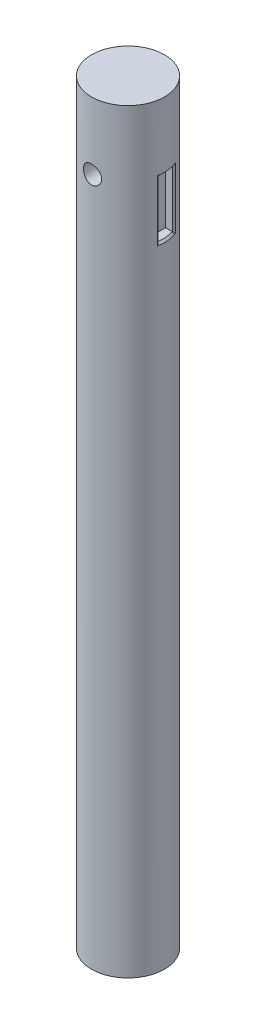
ISO-10303-21;
HEADER;
FILE_DESCRIPTION(('STEP AP214'),'2;1');
FILE_NAME('part.step','',(''),(''),'','','');
FILE_SCHEMA(('AUTOMOTIVE_DESIGN { 1 0 10303 214 1 1 1 1 }'));
ENDSEC;
DATA;
#1=APPLICATION_CONTEXT('core data for automotive mechanical design processes');
#2=APPLICATION_PROTOCOL_DEFINITION('international standard','automotive_design',2000,#1);
#3=PRODUCT_CONTEXT('',#1,'mechanical');
#4=PRODUCT('Part','Part','',(#3));
#5=PRODUCT_RELATED_PRODUCT_CATEGORY('part','',(#4));
#6=PRODUCT_DEFINITION_FORMATION('','',#4);
#7=PRODUCT_DEFINITION_CONTEXT('part definition',#1,'design');
#8=PRODUCT_DEFINITION('design','',#6,#7);
#9=PRODUCT_DEFINITION_SHAPE('','',#8);
#10=(LENGTH_UNIT() NAMED_UNIT(*) SI_UNIT(.MILLI.,.METRE.));
#11=(NAMED_UNIT(*) PLANE_ANGLE_UNIT() SI_UNIT($,.RADIAN.));
#12=(NAMED_UNIT(*) SI_UNIT($,.STERADIAN.) SOLID_ANGLE_UNIT());
#13=UNCERTAINTY_MEASURE_WITH_UNIT(LENGTH_MEASURE(1.E-05),#10,'distance_accuracy_value','');
#14=(GEOMETRIC_REPRESENTATION_CONTEXT(3) GLOBAL_UNCERTAINTY_ASSIGNED_CONTEXT((#13)) GLOBAL_UNIT_ASSIGNED_CONTEXT((#10,
#11,#12)) REPRESENTATION_CONTEXT('',''));
#15=CARTESIAN_POINT('',(0.,0.,0.));
#16=DIRECTION('',(0.,0.,1.));
#17=DIRECTION('',(1.,0.,0.));
#18=AXIS2_PLACEMENT_3D('',#15,#16,#17);
#19=CARTESIAN_POINT('',(0.,394.,0.));
#20=DIRECTION('',(0.,-1.,0.));
#21=DIRECTION('',(0.,0.,-1.));
#22=AXIS2_PLACEMENT_3D('',#19,#20,#21);
#23=CYLINDRICAL_SURFACE('',#22,19.05);
#24=CARTESIAN_POINT('',(0.,360.,0.));
#25=DIRECTION('',(0.,-1.,0.));
#26=DIRECTION('',(0.,0.,-1.));
#27=AXIS2_PLACEMENT_3D('',#24,#25,#26);
#28=CIRCLE('',#27,19.05);
#29=CARTESIAN_POINT('',(18.7710769460592,360.,3.24794862723005));
#30=VERTEX_POINT('',#29);
#31=CARTESIAN_POINT('',(17.7469467547078,360.,-6.92447693949274));
#32=VERTEX_POINT('',#31);
#33=EDGE_CURVE('E200',#30,#32,#28,.F.);
#34=ORIENTED_EDGE('',*,*,#33,.T.);
#35=DIRECTION('',(0.,-1.,0.));
#36=VECTOR('',#35,1.);
#37=CARTESIAN_POINT('',(17.7469467547078,394.,-6.92447693949274));
#38=LINE('',#37,#36);
#39=CARTESIAN_POINT('',(17.7469467547078,328.2,-6.92447693949274));
#40=VERTEX_POINT('',#39);
#41=EDGE_CURVE('E218',#32,#40,#38,.T.);
#42=ORIENTED_EDGE('',*,*,#41,.T.);
#43=CARTESIAN_POINT('',(0.,328.2,0.));
#44=DIRECTION('',(0.,1.,0.));
#45=DIRECTION('',(0.,0.,1.));
#46=AXIS2_PLACEMENT_3D('',#43,#44,#45);
#47=CIRCLE('',#46,19.05);
#48=CARTESIAN_POINT('',(18.7710769460592,328.2,3.24794862723005));
#49=VERTEX_POINT('',#48);
#50=EDGE_CURVE('E213',#40,#49,#47,.F.);
#51=ORIENTED_EDGE('',*,*,#50,.T.);
#52=DIRECTION('',(0.,-1.,0.));
#53=VECTOR('',#52,1.);
#54=CARTESIAN_POINT('',(18.7710769460592,394.,3.24794862723005));
#55=LINE('',#54,#53);
#56=EDGE_CURVE('E211',#49,#30,#55,.F.);
#57=ORIENTED_EDGE('',*,*,#56,.T.);
#58=EDGE_LOOP('',(#34,#42,#51,#57));
#59=FACE_BOUND('',#58,.T.);
#60=CARTESIAN_POINT('',(0.,0.,0.));
#61=DIRECTION('',(0.,1.,0.));
#62=DIRECTION('',(0.,0.,1.));
#63=AXIS2_PLACEMENT_3D('',#60,#61,#62);
#64=CIRCLE('',#63,19.05);
#65=CARTESIAN_POINT('',(0.,0.,19.05));
#66=VERTEX_POINT('',#65);
#67=EDGE_CURVE('E126',#66,#66,#64,.T.);
#68=ORIENTED_EDGE('',*,*,#67,.T.);
#69=EDGE_LOOP('',(#68));
#70=FACE_BOUND('',#69,.T.);
#71=CARTESIAN_POINT('',(0.,394.,0.));
#72=DIRECTION('',(0.,1.,0.));
#73=DIRECTION('',(0.,0.,1.));
#74=AXIS2_PLACEMENT_3D('',#71,#72,#73);
#75=CIRCLE('',#74,19.05);
#76=CARTESIAN_POINT('',(0.,394.,19.05));
#77=VERTEX_POINT('',#76);
#78=EDGE_CURVE('E152',#77,#77,#75,.T.);
#79=ORIENTED_EDGE('',*,*,#78,.F.);
#80=EDGE_LOOP('',(#79));
#81=FACE_BOUND('',#80,.T.);
#82=CARTESIAN_POINT('',(4.76500000000002,359.,18.4444375083655));
#83=CARTESIAN_POINT('',(4.76499253394756,358.736880068242,18.4444425285765));
#84=CARTESIAN_POINT('',(4.74313182145984,358.473677541453,18.4501293147716));
#85=CARTESIAN_POINT('',(4.65640620518508,357.954831138807,18.4722038293386));
#86=CARTESIAN_POINT('',(4.59151629989314,357.699191747664,18.4885977788731));
#87=CARTESIAN_POINT('',(4.42096412981295,357.203051545091,18.530116362269));
#88=CARTESIAN_POINT('',(4.31535453523028,356.962531642371,18.5552297135784));
#89=CARTESIAN_POINT('',(4.06652128468702,356.502597053856,18.6113434099178));
#90=CARTESIAN_POINT('',(3.92329602150706,356.283183270419,18.6423440064788));
#91=CARTESIAN_POINT('',(3.59992696396595,355.866855826511,18.7075036989851));
#92=CARTESIAN_POINT('',(3.41910636519059,355.670475652776,18.7417133012387));
#93=CARTESIAN_POINT('',(3.02713722515421,355.310489970936,18.8089983242118));
#94=CARTESIAN_POINT('',(2.81598584943579,355.146887529385,18.8420736385721));
#95=CARTESIAN_POINT('',(2.36569387066519,354.854918388776,18.9039222142229));
#96=CARTESIAN_POINT('',(2.12620348877931,354.727075821872,18.9326289260712));
#97=CARTESIAN_POINT('',(1.6282940302175,354.513663456559,18.9819296026007));
#98=CARTESIAN_POINT('',(1.36987775584671,354.428087414334,19.0025247654682));
#99=CARTESIAN_POINT('',(0.847013638180613,354.303346197909,19.0329247816014));
#100=CARTESIAN_POINT('',(0.582794371964305,354.263275069739,19.0429399774285));
#101=CARTESIAN_POINT('',(0.0512066238273264,354.227837364209,19.0517846278309));
#102=CARTESIAN_POINT('',(-0.216161386171344,354.232464170752,19.050615737852));
#103=CARTESIAN_POINT('',(-0.740173529842495,354.28563952411,19.0373804769759));
#104=CARTESIAN_POINT('',(-0.996923949372714,354.33321017015,19.0255567446553));
#105=CARTESIAN_POINT('',(-1.49867570045083,354.469350926046,18.992622885621));
#106=CARTESIAN_POINT('',(-1.74367640543007,354.55792321969,18.9715122642813));
#107=CARTESIAN_POINT('',(-2.21754980129284,354.774343937852,18.9220055530041));
#108=CARTESIAN_POINT('',(-2.44625661871719,354.902540279946,18.8935453093686));
#109=CARTESIAN_POINT('',(-2.87925396839516,355.194306109284,18.8324263417817));
#110=CARTESIAN_POINT('',(-3.08354023915232,355.357881756427,18.7997668871067));
#111=CARTESIAN_POINT('',(-3.46772955999337,355.721004651696,18.7327642600676));
#112=CARTESIAN_POINT('',(-3.64682206057596,355.921406395504,18.6983994437385));
#113=CARTESIAN_POINT('',(-3.9690393750814,356.349758243538,18.632668778602));
#114=CARTESIAN_POINT('',(-4.1121625042789,356.577709637389,18.6013030703088));
#115=CARTESIAN_POINT('',(-4.35889808415532,357.056281427722,18.5450444436967));
#116=CARTESIAN_POINT('',(-4.4623151994576,357.307006577916,18.520183712875));
#117=CARTESIAN_POINT('',(-4.62527858668667,357.823056281148,18.4801627604254));
#118=CARTESIAN_POINT('',(-4.68483425787015,358.088377693186,18.4650004605706));
#119=CARTESIAN_POINT('',(-4.75703893537006,358.618571046615,18.4465293229528));
#120=CARTESIAN_POINT('',(-4.77088646820728,358.883269408923,18.442917692324));
#121=CARTESIAN_POINT('',(-4.75456315449025,359.411195338961,18.4471325852967));
#122=CARTESIAN_POINT('',(-4.72439636472194,359.674423039997,18.4549580547444));
#123=CARTESIAN_POINT('',(-4.62195164618803,360.187483708471,18.4808752454782));
#124=CARTESIAN_POINT('',(-4.55037170986199,360.437465469567,18.4987966771173));
#125=CARTESIAN_POINT('',(-4.3679065766642,360.921881551656,18.5427247883423));
#126=CARTESIAN_POINT('',(-4.25701671996747,361.156314025512,18.5687324264277));
#127=CARTESIAN_POINT('',(-3.99657145809522,361.608054560514,18.6265399386717));
#128=CARTESIAN_POINT('',(-3.8462995878392,361.824935987912,18.6584435191855));
#129=CARTESIAN_POINT('',(-3.51226176217666,362.230844297488,18.7241938256162));
#130=CARTESIAN_POINT('',(-3.32849029641703,362.419866587849,18.7580408705853));
#131=CARTESIAN_POINT('',(-2.92716913307845,362.769546987513,18.824890712737));
#132=CARTESIAN_POINT('',(-2.70888859662654,362.929375944846,18.8578511212472));
#133=CARTESIAN_POINT('',(-2.24789098441666,363.21011029119,18.91833630164));
#134=CARTESIAN_POINT('',(-2.00517518449521,363.331017711027,18.9458613570961));
#135=CARTESIAN_POINT('',(-1.50387454132551,363.529426643736,18.9922009859132));
#136=CARTESIAN_POINT('',(-1.24541934639064,363.607240441396,19.0110780510668));
#137=CARTESIAN_POINT('',(-0.718566131278507,363.718190436356,19.0382683438607));
#138=CARTESIAN_POINT('',(-0.450170042410288,363.751335265612,19.046583612474));
#139=CARTESIAN_POINT('',(0.0811569645299681,363.771520485466,19.0516300031007));
#140=CARTESIAN_POINT('',(0.344039181675933,363.759784471426,19.0486685735105));
#141=CARTESIAN_POINT('',(0.863959572964795,363.693344058803,19.0321762045503));
#142=CARTESIAN_POINT('',(1.12099792100998,363.638640940563,19.018645580124));
#143=CARTESIAN_POINT('',(1.62065205147048,363.488475647959,18.9825827762077));
#144=CARTESIAN_POINT('',(1.86333815295653,363.393234927861,18.9600995466223));
#145=CARTESIAN_POINT('',(2.3294229185804,363.164898899249,18.9084989834101));
#146=CARTESIAN_POINT('',(2.55281914450257,363.031798814464,18.8793808128229));
#147=CARTESIAN_POINT('',(2.97978360927443,362.727791723533,18.8167772861324));
#148=CARTESIAN_POINT('',(3.18274795985907,362.556054695466,18.7832039537837));
#149=CARTESIAN_POINT('',(3.55739239819725,362.181259900192,18.7158694747159));
#150=CARTESIAN_POINT('',(3.72906453995355,361.978194201833,18.6821082825303));
#151=CARTESIAN_POINT('',(4.03940000761458,361.541940131255,18.6175025683245));
#152=CARTESIAN_POINT('',(4.17738679555634,361.308259908803,18.5867243135507));
#153=CARTESIAN_POINT('',(4.41191121503437,360.820282184805,18.5324615547298));
#154=CARTESIAN_POINT('',(4.50847898039926,360.565999832729,18.508971751525));
#155=CARTESIAN_POINT('',(4.6430615235032,360.093474198049,18.4756133752866));
#156=CARTESIAN_POINT('',(4.68868870992555,359.8774902163,18.4640104602906));
#157=CARTESIAN_POINT('',(4.74965978251172,359.441023240886,18.4484207485055));
#158=CARTESIAN_POINT('',(4.76500625786094,359.220540633512,18.4444333005485));
#159=CARTESIAN_POINT('',(4.76500000000002,359.,18.4444375083655));
#160=B_SPLINE_CURVE_WITH_KNOTS('',3,(#82,#83,#84,#85,#86,#87,#88,#89,#90,#91,#92,#93,#94,#95,
#96,#97,#98,#99,#100,#101,#102,#103,#104,#105,#106,#107,#108,#109,#110,#111,#112,#113,#114,#115,
#116,#117,#118,#119,#120,#121,#122,#123,#124,#125,#126,#127,#128,#129,#130,#131,#132,#133,#134,
#135,#136,#137,#138,#139,#140,#141,#142,#143,#144,#145,#146,#147,#148,#149,#150,#151,#152,#153,
#154,#155,#156,#157,#158,#159),.UNSPECIFIED.,.T.,.F.,(4,2,2,2,2,2,2,2,2,2,2,2,2,2,2,2,2,2,2,2,2,
2,2,2,2,2,2,2,2,2,2,2,2,2,2,2,2,2,4),(0.,0.788549891288974,1.57755836029502,2.36554966597998,
3.15357464595635,3.95725215471359,4.76100481728096,5.57598509752509,6.39084494888725,
7.18918063523408,7.98739815537882,8.76788515535764,9.54841372963677,10.3360003461753,
11.1237242001489,11.932789468102,12.7418926238134,13.5549266948542,14.3677864866061,
15.1591552295999,15.9504510369988,16.728783250779,17.5072077594643,18.3009170589978,
19.0947570338869,19.9084830626429,20.7221666263988,21.5298738556445,22.3374249789063,
23.1231186778021,23.9087889652832,24.6902211892097,25.4717520410272,26.2720227559754,
27.0724964005802,27.887923493764,28.7027563239447,29.3637559048892,30.0246989638899),.UNSPECIFIED.);
#161=CARTESIAN_POINT('',(4.76500000000002,359.,18.4444375083655));
#162=VERTEX_POINT('',#161);
#163=EDGE_CURVE('E155',#162,#162,#160,.T.);
#164=ORIENTED_EDGE('',*,*,#163,.T.);
#165=EDGE_LOOP('',(#164));
#166=FACE_BOUND('',#165,.T.);
#167=CARTESIAN_POINT('',(0.,363.765,-19.05));
#168=CARTESIAN_POINT('',(-0.26326521125486,363.764992620144,-19.0499955515464));
#169=CARTESIAN_POINT('',(-0.526612834496201,363.743108589917,-19.0444882667373));
#170=CARTESIAN_POINT('',(-1.04576024353248,363.656281974442,-19.0230522770523));
#171=CARTESIAN_POINT('',(-1.30155567066715,363.591315012891,-19.0071176724709));
#172=CARTESIAN_POINT('',(-1.79802679301538,363.420537663011,-18.9665915031212));
#173=CARTESIAN_POINT('',(-2.0387202526176,363.314776349414,-18.9420103430908));
#174=CARTESIAN_POINT('',(-2.4989488240798,363.065585179318,-18.886808821123));
#175=CARTESIAN_POINT('',(-2.7184832164683,362.92215404255,-18.8561882539356));
#176=CARTESIAN_POINT('',(-3.13468790260628,362.598571393309,-18.7915262162897));
#177=CARTESIAN_POINT('',(-3.3308598616217,362.41778942701,-18.7574319232655));
#178=CARTESIAN_POINT('',(-3.69043987258169,362.02598664335,-18.6900159213816));
#179=CARTESIAN_POINT('',(-3.85384422121505,361.814962412702,-18.6566943002231));
#180=CARTESIAN_POINT('',(-4.1455949750689,361.364795076123,-18.5940638080123));
#181=CARTESIAN_POINT('',(-4.2733837991845,361.125280428019,-18.5648219918294));
#182=CARTESIAN_POINT('',(-4.48669026961246,360.627318980245,-18.5144323480421));
#183=CARTESIAN_POINT('',(-4.57221468179625,360.368875218443,-18.4932832250464));
#184=CARTESIAN_POINT('',(-4.69686433359866,359.845871711618,-18.4620164523183));
#185=CARTESIAN_POINT('',(-4.73688563940207,359.581538542251,-18.4516860894675));
#186=CARTESIAN_POINT('',(-4.77218413773464,359.049723670487,-18.4425897804384));
#187=CARTESIAN_POINT('',(-4.76746861781131,358.782242487986,-18.4438219507441));
#188=CARTESIAN_POINT('',(-4.714142227105,358.258593091358,-18.4575202823196));
#189=CARTESIAN_POINT('',(-4.666599264599,358.002307858781,-18.4697131224584));
#190=CARTESIAN_POINT('',(-4.53067116110666,357.501471654451,-18.5035233716592));
#191=CARTESIAN_POINT('',(-4.44228310778031,357.256921520807,-18.5251414527542));
#192=CARTESIAN_POINT('',(-4.22626405623028,356.783634436915,-18.5756171646484));
#193=CARTESIAN_POINT('',(-4.09824558451351,356.555082221851,-18.6045457343777));
#194=CARTESIAN_POINT('',(-3.80687066061065,356.122320934521,-18.6663428672246));
#195=CARTESIAN_POINT('',(-3.64350801875435,355.918116135841,-18.6992121200066));
#196=CARTESIAN_POINT('',(-3.28055094507251,355.533726714641,-18.7663377909751));
#197=CARTESIAN_POINT('',(-3.08005537492096,355.35439415423,-18.8006070231433));
#198=CARTESIAN_POINT('',(-2.65142565171569,355.031735263645,-18.8658253171989));
#199=CARTESIAN_POINT('',(-2.42329065299133,354.888410035584,-18.8967742774429));
#200=CARTESIAN_POINT('',(-1.94464142166658,354.641520890416,-18.9520192245389));
#201=CARTESIAN_POINT('',(-1.69405287727384,354.53809550092,-18.9762919500539));
#202=CARTESIAN_POINT('',(-1.17830380293655,354.375075177787,-19.0152803673754));
#203=CARTESIAN_POINT('',(-0.913146073888303,354.315471850913,-19.0299978892262));
#204=CARTESIAN_POINT('',(-0.383070389815676,354.243089137922,-19.0479467753632));
#205=CARTESIAN_POINT('',(-0.118320282238044,354.22914942532,-19.0514627104745));
#206=CARTESIAN_POINT('',(0.409730011595897,354.245307001117,-19.0474228424188));
#207=CARTESIAN_POINT('',(0.673030326369713,354.275400320989,-19.0398680370146));
#208=CARTESIAN_POINT('',(1.18667400021568,354.377813359581,-19.0147179247928));
#209=CARTESIAN_POINT('',(1.43715163707319,354.44949996186,-18.9972732469182));
#210=CARTESIAN_POINT('',(1.92251297115368,354.632341387155,-18.9543097733156));
#211=CARTESIAN_POINT('',(2.15739508973183,354.743500198507,-18.9287901617114));
#212=CARTESIAN_POINT('',(2.60951359661004,355.004378690255,-18.871826229655));
#213=CARTESIAN_POINT('',(2.82636253382392,355.154748119556,-18.8402847401568));
#214=CARTESIAN_POINT('',(3.23216102113293,355.488948981439,-18.7749288358825));
#215=CARTESIAN_POINT('',(3.42110574075645,355.672786195327,-18.7411140290455));
#216=CARTESIAN_POINT('',(3.77051471095469,356.07409168763,-18.673998119737));
#217=CARTESIAN_POINT('',(3.93016499899017,356.292275389046,-18.6407300602087));
#218=CARTESIAN_POINT('',(4.2105854147061,356.753021521654,-18.5794013573027));
#219=CARTESIAN_POINT('',(4.33135726781047,356.99558287034,-18.5513404828537));
#220=CARTESIAN_POINT('',(4.52969340489564,357.496898945324,-18.5039125929347));
#221=CARTESIAN_POINT('',(4.60751366895123,357.755547283737,-18.4844942078739));
#222=CARTESIAN_POINT('',(4.71841159828721,358.282816173773,-18.4565008772953));
#223=CARTESIAN_POINT('',(4.75149906088238,358.551434528531,-18.4479235574097));
#224=CARTESIAN_POINT('',(4.77147984461422,359.082735021092,-18.4427646152436));
#225=CARTESIAN_POINT('',(4.75967418884682,359.345365732915,-18.4458451309353));
#226=CARTESIAN_POINT('',(4.69318177062746,359.864764098748,-18.4628735437947));
#227=CARTESIAN_POINT('',(4.63849587168856,360.121531870715,-18.4768212221219));
#228=CARTESIAN_POINT('',(4.48850620730767,360.620499353916,-18.5138240010824));
#229=CARTESIAN_POINT('',(4.39344670349075,360.862776835954,-18.5368242728665));
#230=CARTESIAN_POINT('',(4.16560150003316,361.32811732356,-18.5893483537122));
#231=CARTESIAN_POINT('',(4.03281056243546,361.551177655755,-18.618873068384));
#232=CARTESIAN_POINT('',(3.72919412213602,361.978038269465,-18.6820826268311));
#233=CARTESIAN_POINT('',(3.55746599960889,362.181183538894,-18.7158559691186));
#234=CARTESIAN_POINT('',(3.18260855149614,362.556196890561,-18.7832292865691));
#235=CARTESIAN_POINT('',(2.97947177857618,362.728057533774,-18.8168292186571));
#236=CARTESIAN_POINT('',(2.54311718061299,363.038662123919,-18.8807970293255));
#237=CARTESIAN_POINT('',(2.30942064553615,363.17674898282,-18.9110952448362));
#238=CARTESIAN_POINT('',(1.82139399193014,363.411456333857,-18.9643106376113));
#239=CARTESIAN_POINT('',(1.56707880237167,363.508106515025,-18.9872330965958));
#240=CARTESIAN_POINT('',(1.09435178682454,363.642864288432,-19.0197288497069));
#241=CARTESIAN_POINT('',(0.878190056555764,363.688566119122,-19.0310025178053));
#242=CARTESIAN_POINT('',(0.441371299102448,363.749635925223,-19.0461396784107));
#243=CARTESIAN_POINT('',(0.220714612022164,363.765006187076,-19.0500037294662));
#244=CARTESIAN_POINT('',(0.,363.765,-19.05));
#245=B_SPLINE_CURVE_WITH_KNOTS('',3,(#167,#168,#169,#170,#171,#172,#173,#174,#175,#176,#177,
#178,#179,#180,#181,#182,#183,#184,#185,#186,#187,#188,#189,#190,#191,#192,#193,#194,#195,#196,
#197,#198,#199,#200,#201,#202,#203,#204,#205,#206,#207,#208,#209,#210,#211,#212,#213,#214,#215,
#216,#217,#218,#219,#220,#221,#222,#223,#224,#225,#226,#227,#228,#229,#230,#231,#232,#233,#234,
#235,#236,#237,#238,#239,#240,#241,#242,#243,#244),.UNSPECIFIED.,.T.,.F.,(4,2,2,2,2,2,2,2,2,2,2,
2,2,2,2,2,2,2,2,2,2,2,2,2,2,2,2,2,2,2,2,2,2,2,2,2,2,2,4),(0.,0.788986790709137,1.57842037111027,
2.36690722681282,3.15542088397196,3.95852747037524,4.76172477073223,5.57686839212704,
6.39188147946916,7.19055082686619,7.98909007471397,8.76825256617256,9.54747062211313,
10.3345616140848,11.1217905575999,11.9314913183108,12.7412168593157,13.553728902364,
14.3660852844672,15.1576324402231,15.9491082612997,16.7288413462058,17.5086532390679,
18.3023138998786,19.0961117898661,19.909416117703,20.7226843461374,21.5310518823165,
22.3392423422858,23.1241920278443,23.9091259066618,24.6893770793649,25.4697366211415,
26.2704729859314,27.0713995060536,27.8868507374529,28.7017167244678,29.3632323158843,
30.0246980392586),.UNSPECIFIED.);
#246=CARTESIAN_POINT('',(0.,363.765,-19.05));
#247=VERTEX_POINT('',#246);
#248=EDGE_CURVE('E165',#247,#247,#245,.T.);
#249=ORIENTED_EDGE('',*,*,#248,.T.);
#250=EDGE_LOOP('',(#249));
#251=FACE_BOUND('',#250,.T.);
#252=ADVANCED_FACE('F45',(#59,#70,#81,#166,#251),#23,.T.);
#253=CARTESIAN_POINT('',(0.,394.,0.));
#254=DIRECTION('',(0.,1.,0.));
#255=DIRECTION('',(0.,0.,1.));
#256=AXIS2_PLACEMENT_3D('',#253,#254,#255);
#257=PLANE('',#256);
#258=ORIENTED_EDGE('',*,*,#78,.T.);
#259=EDGE_LOOP('',(#258));
#260=FACE_BOUND('',#259,.T.);
#261=ADVANCED_FACE('F182',(#260),#257,.T.);
#262=CARTESIAN_POINT('',(0.,0.,0.));
#263=DIRECTION('',(0.,1.,0.));
#264=DIRECTION('',(0.,0.,1.));
#265=AXIS2_PLACEMENT_3D('',#262,#263,#264);
#266=PLANE('',#265);
#267=ORIENTED_EDGE('',*,*,#67,.F.);
#268=EDGE_LOOP('',(#267));
#269=FACE_BOUND('',#268,.T.);
#270=ADVANCED_FACE('F178',(#269),#266,.F.);
#271=CARTESIAN_POINT('',(0.,359.,-19.05));
#272=DIRECTION('',(0.,0.,1.));
#273=DIRECTION('',(1.,0.,0.));
#274=AXIS2_PLACEMENT_3D('',#271,#272,#273);
#275=CYLINDRICAL_SURFACE('',#274,4.76500000000001);
#276=ORIENTED_EDGE('',*,*,#163,.F.);
#277=EDGE_LOOP('',(#276));
#278=FACE_BOUND('',#277,.T.);
#279=ORIENTED_EDGE('',*,*,#248,.F.);
#280=EDGE_LOOP('',(#279));
#281=FACE_BOUND('',#280,.T.);
#282=ADVANCED_FACE('F173',(#278,#281),#275,.F.);
#283=CARTESIAN_POINT('',(19.050012,329.2,-6.00706364757789));
#284=DIRECTION('',(0.,0.,1.));
#285=DIRECTION('',(1.,0.,0.));
#286=AXIS2_PLACEMENT_3D('',#283,#284,#285);
#287=PLANE('',#286);
#288=DIRECTION('',(-1.,0.,0.));
#289=VECTOR('',#288,1.);
#290=CARTESIAN_POINT('',(19.050012,329.2,-6.00706364757789));
#291=LINE('',#290,#289);
#292=CARTESIAN_POINT('',(17.0210953329669,329.2,-6.00706364757789));
#293=VERTEX_POINT('',#292);
#294=CARTESIAN_POINT('',(13.6,329.2,-6.00706364757789));
#295=VERTEX_POINT('',#294);
#296=EDGE_CURVE('E147',#293,#295,#291,.T.);
#297=ORIENTED_EDGE('',*,*,#296,.F.);
#298=CARTESIAN_POINT('',(17.0210953329669,329.2,-6.00706364757789));
#299=CARTESIAN_POINT('',(17.0654565201665,329.158167273964,-6.00706364757789));
#300=CARTESIAN_POINT('',(17.1098088586606,329.116325172334,-6.00706364757789));
#301=CARTESIAN_POINT('',(17.1984958382102,329.03262221791,-6.00706364757789));
#302=CARTESIAN_POINT('',(17.2428304792658,328.990761365117,-6.00706364757789));
#303=CARTESIAN_POINT('',(17.2871562716159,328.948891136728,-6.00706364757789));
#304=B_SPLINE_CURVE_WITH_KNOTS('',3,(#298,#299,#300,#301,#302,#303),.UNSPECIFIED.,.F.,.F.,(4,2,
4),(0.,0.182923543013357,0.365847085913804),.UNSPECIFIED.);
#305=CARTESIAN_POINT('',(17.2871562716159,328.948891136728,-6.00706364757789));
#306=VERTEX_POINT('',#305);
#307=EDGE_CURVE('E60',#293,#306,#304,.T.);
#308=ORIENTED_EDGE('',*,*,#307,.T.);
#309=DIRECTION('',(0.,1.,0.));
#310=VECTOR('',#309,1.);
#311=CARTESIAN_POINT('',(17.2871562716159,359.,-6.00706364757789));
#312=LINE('',#311,#310);
#313=CARTESIAN_POINT('',(17.2871562716159,359.251108863272,-6.00706364757789));
#314=VERTEX_POINT('',#313);
#315=EDGE_CURVE('E210',#306,#314,#312,.T.);
#316=ORIENTED_EDGE('',*,*,#315,.T.);
#317=CARTESIAN_POINT('',(17.2871562716159,359.251108863272,-6.00706364757789));
#318=CARTESIAN_POINT('',(17.2428304792659,359.209238634883,-6.00706364757789));
#319=CARTESIAN_POINT('',(17.1984958382103,359.16737778209,-6.00706364757789));
#320=CARTESIAN_POINT('',(17.1098088586606,359.083674827666,-6.00706364757789));
#321=CARTESIAN_POINT('',(17.0654565201666,359.041832726036,-6.00706364757789));
#322=CARTESIAN_POINT('',(17.021095332967,359.,-6.00706364757789));
#323=B_SPLINE_CURVE_WITH_KNOTS('',3,(#317,#318,#319,#320,#321,#322),.UNSPECIFIED.,.F.,.F.,(4,2,
4),(0.,0.182923542900389,0.365847085913736),.UNSPECIFIED.);
#324=CARTESIAN_POINT('',(17.021095332967,359.,-6.00706364757789));
#325=VERTEX_POINT('',#324);
#326=EDGE_CURVE('E123',#314,#325,#323,.T.);
#327=ORIENTED_EDGE('',*,*,#326,.T.);
#328=DIRECTION('',(-1.,0.,0.));
#329=VECTOR('',#328,1.);
#330=CARTESIAN_POINT('',(19.050012,359.,-6.00706364757789));
#331=LINE('',#330,#329);
#332=CARTESIAN_POINT('',(13.6,359.,-6.00706364757789));
#333=VERTEX_POINT('',#332);
#334=EDGE_CURVE('E115',#325,#333,#331,.T.);
#335=ORIENTED_EDGE('',*,*,#334,.T.);
#336=DIRECTION('',(0.,1.,0.));
#337=VECTOR('',#336,1.);
#338=CARTESIAN_POINT('',(13.6,329.2,-6.00706364757789));
#339=LINE('',#338,#337);
#340=EDGE_CURVE('E120',#295,#333,#339,.T.);
#341=ORIENTED_EDGE('',*,*,#340,.F.);
#342=EDGE_LOOP('',(#297,#308,#316,#327,#335,#341));
#343=FACE_BOUND('',#342,.T.);
#344=ADVANCED_FACE('F118',(#343),#287,.T.);
#345=CARTESIAN_POINT('',(19.050012,359.,2.28293635242211));
#346=DIRECTION('',(0.,-1.,0.));
#347=DIRECTION('',(0.,0.,-1.));
#348=AXIS2_PLACEMENT_3D('',#345,#346,#347);
#349=PLANE('',#348);
#350=ORIENTED_EDGE('',*,*,#334,.F.);
#351=CARTESIAN_POINT('',(0.,359.,0.));
#352=DIRECTION('',(0.,-1.,0.));
#353=DIRECTION('',(0.,0.,-1.));
#354=AXIS2_PLACEMENT_3D('',#351,#352,#353);
#355=CIRCLE('',#354,18.05);
#356=CARTESIAN_POINT('',(17.9050468195643,359.,2.28293635242211));
#357=VERTEX_POINT('',#356);
#358=EDGE_CURVE('E220',#325,#357,#355,.T.);
#359=ORIENTED_EDGE('',*,*,#358,.T.);
#360=DIRECTION('',(-1.,0.,0.));
#361=VECTOR('',#360,1.);
#362=CARTESIAN_POINT('',(19.050012,359.,2.28293635242211));
#363=LINE('',#362,#361);
#364=CARTESIAN_POINT('',(13.6,359.,2.28293635242211));
#365=VERTEX_POINT('',#364);
#366=EDGE_CURVE('E127',#357,#365,#363,.T.);
#367=ORIENTED_EDGE('',*,*,#366,.T.);
#368=DIRECTION('',(0.,0.,1.));
#369=VECTOR('',#368,1.);
#370=CARTESIAN_POINT('',(13.6,359.,2.28293635242211));
#371=LINE('',#370,#369);
#372=EDGE_CURVE('E130',#333,#365,#371,.T.);
#373=ORIENTED_EDGE('',*,*,#372,.F.);
#374=EDGE_LOOP('',(#350,#359,#367,#373));
#375=FACE_BOUND('',#374,.T.);
#376=ADVANCED_FACE('F131',(#375),#349,.T.);
#377=CARTESIAN_POINT('',(19.050012,329.2,2.28293635242211));
#378=DIRECTION('',(0.,0.,-1.));
#379=DIRECTION('',(-1.,0.,0.));
#380=AXIS2_PLACEMENT_3D('',#377,#378,#379);
#381=PLANE('',#380);
#382=CARTESIAN_POINT('',(17.9050468195643,359.,2.28293635242211));
#383=CARTESIAN_POINT('',(17.9231966728105,359.018004100798,2.28293635242211));
#384=CARTESIAN_POINT('',(17.9413463090667,359.036008420332,2.28293635242211));
#385=CARTESIAN_POINT('',(17.9776451475991,359.072017496872,2.28293635242211));
#386=CARTESIAN_POINT('',(17.9957943498752,359.090022253878,2.28293635242211));
#387=CARTESIAN_POINT('',(18.0139433351614,359.10802722962,2.28293635242211));
#388=B_SPLINE_CURVE_WITH_KNOTS('',3,(#382,#383,#384,#385,#386,#387),.UNSPECIFIED.,.F.,.F.,(4,2,
4),(0.,0.0766947414298417,0.153389482859611),.UNSPECIFIED.);
#389=CARTESIAN_POINT('',(18.0139433351614,359.10802722962,2.28293635242211));
#390=VERTEX_POINT('',#389);
#391=EDGE_CURVE('E225',#357,#390,#388,.T.);
#392=ORIENTED_EDGE('',*,*,#391,.T.);
#393=DIRECTION('',(0.,-1.,0.));
#394=VECTOR('',#393,1.);
#395=CARTESIAN_POINT('',(18.0139433351614,329.2,2.28293635242211));
#396=LINE('',#395,#394);
#397=CARTESIAN_POINT('',(18.0139433351614,329.09197277038,2.28293635242211));
#398=VERTEX_POINT('',#397);
#399=EDGE_CURVE('E67',#390,#398,#396,.T.);
#400=ORIENTED_EDGE('',*,*,#399,.T.);
#401=CARTESIAN_POINT('',(18.0139433351614,329.09197277038,2.28293635242211));
#402=CARTESIAN_POINT('',(17.9957943498753,329.109977746122,2.28293635242211));
#403=CARTESIAN_POINT('',(17.9776451475991,329.127982503128,2.28293635242211));
#404=CARTESIAN_POINT('',(17.9413463090667,329.163991579668,2.28293635242211));
#405=CARTESIAN_POINT('',(17.9231966728105,329.181995899202,2.28293635242211));
#406=CARTESIAN_POINT('',(17.9050468195643,329.2,2.28293635242211));
#407=B_SPLINE_CURVE_WITH_KNOTS('',3,(#401,#402,#403,#404,#405,#406),.UNSPECIFIED.,.F.,.F.,(4,2,
4),(0.,0.0766947414298326,0.153389482859738),.UNSPECIFIED.);
#408=CARTESIAN_POINT('',(17.9050468195643,329.2,2.28293635242211));
#409=VERTEX_POINT('',#408);
#410=EDGE_CURVE('E11',#398,#409,#407,.T.);
#411=ORIENTED_EDGE('',*,*,#410,.T.);
#412=DIRECTION('',(-1.,0.,0.));
#413=VECTOR('',#412,1.);
#414=CARTESIAN_POINT('',(19.050012,329.2,2.28293635242211));
#415=LINE('',#414,#413);
#416=CARTESIAN_POINT('',(13.6,329.2,2.28293635242211));
#417=VERTEX_POINT('',#416);
#418=EDGE_CURVE('E149',#409,#417,#415,.T.);
#419=ORIENTED_EDGE('',*,*,#418,.T.);
#420=DIRECTION('',(0.,-1.,0.));
#421=VECTOR('',#420,1.);
#422=CARTESIAN_POINT('',(13.6,329.2,2.28293635242211));
#423=LINE('',#422,#421);
#424=EDGE_CURVE('E136',#365,#417,#423,.T.);
#425=ORIENTED_EDGE('',*,*,#424,.F.);
#426=ORIENTED_EDGE('',*,*,#366,.F.);
#427=EDGE_LOOP('',(#392,#400,#411,#419,#425,#426));
#428=FACE_BOUND('',#427,.T.);
#429=ADVANCED_FACE('F241',(#428),#381,.T.);
#430=CARTESIAN_POINT('',(19.050012,329.2,2.28293635242211));
#431=DIRECTION('',(0.,1.,0.));
#432=DIRECTION('',(0.,0.,1.));
#433=AXIS2_PLACEMENT_3D('',#430,#431,#432);
#434=PLANE('',#433);
#435=ORIENTED_EDGE('',*,*,#418,.F.);
#436=CARTESIAN_POINT('',(0.,329.2,0.));
#437=DIRECTION('',(0.,1.,0.));
#438=DIRECTION('',(0.,0.,1.));
#439=AXIS2_PLACEMENT_3D('',#436,#437,#438);
#440=CIRCLE('',#439,18.05);
#441=EDGE_CURVE('E222',#409,#293,#440,.T.);
#442=ORIENTED_EDGE('',*,*,#441,.T.);
#443=ORIENTED_EDGE('',*,*,#296,.T.);
#444=DIRECTION('',(0.,0.,-1.));
#445=VECTOR('',#444,1.);
#446=CARTESIAN_POINT('',(13.6,329.2,2.28293635242211));
#447=LINE('',#446,#445);
#448=EDGE_CURVE('E140',#417,#295,#447,.T.);
#449=ORIENTED_EDGE('',*,*,#448,.F.);
#450=EDGE_LOOP('',(#435,#442,#443,#449));
#451=FACE_BOUND('',#450,.T.);
#452=ADVANCED_FACE('F245',(#451),#434,.T.);
#453=CARTESIAN_POINT('',(13.6,0.,0.));
#454=DIRECTION('',(-1.,0.,0.));
#455=DIRECTION('',(0.,0.,1.));
#456=AXIS2_PLACEMENT_3D('',#453,#454,#455);
#457=PLANE('',#456);
#458=ORIENTED_EDGE('',*,*,#340,.T.);
#459=ORIENTED_EDGE('',*,*,#372,.T.);
#460=ORIENTED_EDGE('',*,*,#424,.T.);
#461=ORIENTED_EDGE('',*,*,#448,.T.);
#462=EDGE_LOOP('',(#458,#459,#460,#461));
#463=FACE_BOUND('',#462,.T.);
#464=ADVANCED_FACE('F138',(#463),#457,.F.);
#465=CARTESIAN_POINT('',(18.0139433351614,394.,2.28293635242211));
#466=DIRECTION('',(-0.786749982963788,0.,0.617271791277133));
#467=DIRECTION('',(0.,-1.,0.));
#468=AXIS2_PLACEMENT_3D('',#465,#466,#467);
#469=PLANE('',#468);
#470=CARTESIAN_POINT('',(18.0139433351614,359.10802722962,2.28293635242211));
#471=CARTESIAN_POINT('',(18.0775174711185,359.181284759428,2.36396540816054));
#472=CARTESIAN_POINT('',(18.1409655250461,359.254829143086,2.44483376477757));
#473=CARTESIAN_POINT('',(18.2676174843139,359.402462077249,2.60625929596882));
#474=CARTESIAN_POINT('',(18.3308213959147,359.476550613657,2.68681647852255));
#475=CARTESIAN_POINT('',(18.4569962510612,359.625245960576,2.84763391184729));
#476=CARTESIAN_POINT('',(18.5199671950364,359.699852770132,2.92789416316573));
#477=CARTESIAN_POINT('',(18.6456868803389,359.8495616621,3.0881314551782));
#478=CARTESIAN_POINT('',(18.708435615888,359.924663757248,3.16810848850762));
#479=CARTESIAN_POINT('',(18.7710769460592,360.,3.24794862723005));
#480=B_SPLINE_CURVE_WITH_KNOTS('',3,(#470,#471,#472,#473,#474,#475,#476,#477,#478,#479),
.UNSPECIFIED.,.F.,.F.,(4,2,2,2,4),(0.,0.37916464900376,0.758319509595466,1.13747367081705,
1.516637619961),.UNSPECIFIED.);
#481=EDGE_CURVE('E143',#30,#390,#480,.F.);
#482=ORIENTED_EDGE('',*,*,#481,.F.);
#483=ORIENTED_EDGE('',*,*,#56,.F.);
#484=CARTESIAN_POINT('',(18.7710769460592,328.2,3.24794862723005));
#485=CARTESIAN_POINT('',(18.708435615888,328.275336242752,3.16810848850762));
#486=CARTESIAN_POINT('',(18.6456868803389,328.3504383379,3.0881314551782));
#487=CARTESIAN_POINT('',(18.5199671950364,328.500147229868,2.92789416316573));
#488=CARTESIAN_POINT('',(18.4569962510612,328.574754039424,2.84763391184729));
#489=CARTESIAN_POINT('',(18.3308213959147,328.723449386343,2.68681647852257));
#490=CARTESIAN_POINT('',(18.2676174843139,328.797537922751,2.60625929596885));
#491=CARTESIAN_POINT('',(18.1409655250461,328.945170856913,2.44483376477761));
#492=CARTESIAN_POINT('',(18.0775174711185,329.018715240571,2.36396540816057));
#493=CARTESIAN_POINT('',(18.0139433351614,329.09197277038,2.28293635242213));
#494=B_SPLINE_CURVE_WITH_KNOTS('',3,(#484,#485,#486,#487,#488,#489,#490,#491,#492,#493),
.UNSPECIFIED.,.F.,.F.,(4,2,2,2,4),(0.,0.379163949143949,0.758318110365532,1.13747297095716,
1.51663761996095),.UNSPECIFIED.);
#495=EDGE_CURVE('E51',#398,#49,#494,.F.);
#496=ORIENTED_EDGE('',*,*,#495,.F.);
#497=ORIENTED_EDGE('',*,*,#399,.F.);
#498=EDGE_LOOP('',(#482,#483,#496,#497));
#499=FACE_BOUND('',#498,.T.);
#500=ADVANCED_FACE('F48',(#499),#469,.F.);
#501=CARTESIAN_POINT('',(0.,329.2,0.));
#502=DIRECTION('',(0.,-1.,0.));
#503=DIRECTION('',(0.,0.,-1.));
#504=AXIS2_PLACEMENT_3D('',#501,#502,#503);
#505=CONICAL_SURFACE('',#504,18.05,0.785398163397462);
#506=ORIENTED_EDGE('',*,*,#495,.T.);
#507=ORIENTED_EDGE('',*,*,#50,.F.);
#508=CARTESIAN_POINT('',(17.7469467547078,328.2,-6.92447693949274));
#509=CARTESIAN_POINT('',(17.7088596984641,328.26310489868,-6.84848238777237));
#510=CARTESIAN_POINT('',(17.6707179204631,328.32604539774,-6.77237865052214));
#511=CARTESIAN_POINT('',(17.5943217759684,328.451581949856,-6.61994652983282));
#512=CARTESIAN_POINT('',(17.5560674114632,328.51417800894,-6.54361815036133));
#513=CARTESIAN_POINT('',(17.4794415716789,328.639012316693,-6.39072772198709));
#514=CARTESIAN_POINT('',(17.4410700962769,328.701250564987,-6.31416567283941));
#515=CARTESIAN_POINT('',(17.3642053637778,328.825354499039,-6.16079858529117));
#516=CARTESIAN_POINT('',(17.3257121045542,328.887220178236,-6.08399354264781));
#517=CARTESIAN_POINT('',(17.2871562716159,328.948891136728,-6.00706364757789));
#518=B_SPLINE_CURVE_WITH_KNOTS('',3,(#508,#509,#510,#511,#512,#513,#514,#515,#516,#517),
.UNSPECIFIED.,.F.,.F.,(4,2,2,2,4),(0.,0.31760376695986,0.635201957696871,0.952800481422411,
1.270404581533),.UNSPECIFIED.);
#519=EDGE_CURVE('E272',#306,#40,#518,.F.);
#520=ORIENTED_EDGE('',*,*,#519,.F.);
#521=ORIENTED_EDGE('',*,*,#307,.F.);
#522=ORIENTED_EDGE('',*,*,#441,.F.);
#523=ORIENTED_EDGE('',*,*,#410,.F.);
#524=EDGE_LOOP('',(#506,#507,#520,#521,#522,#523));
#525=FACE_BOUND('',#524,.T.);
#526=ADVANCED_FACE('F264',(#525),#505,.T.);
#527=CARTESIAN_POINT('',(0.,359.,0.));
#528=DIRECTION('',(0.,1.,0.));
#529=DIRECTION('',(0.,0.,1.));
#530=AXIS2_PLACEMENT_3D('',#527,#528,#529);
#531=CONICAL_SURFACE('',#530,18.05,0.78539816339746);
#532=ORIENTED_EDGE('',*,*,#358,.F.);
#533=ORIENTED_EDGE('',*,*,#326,.F.);
#534=CARTESIAN_POINT('',(17.2871562716159,359.251108863272,-6.00706364757789));
#535=CARTESIAN_POINT('',(17.3257121045542,359.312779821764,-6.08399354264781));
#536=CARTESIAN_POINT('',(17.3642053637778,359.374645500961,-6.16079858529117));
#537=CARTESIAN_POINT('',(17.4410700962769,359.498749435013,-6.31416567283941));
#538=CARTESIAN_POINT('',(17.4794415716789,359.560987683307,-6.39072772198709));
#539=CARTESIAN_POINT('',(17.5560674114632,359.68582199106,-6.54361815036133));
#540=CARTESIAN_POINT('',(17.5943217759684,359.748418050144,-6.61994652983282));
#541=CARTESIAN_POINT('',(17.6707179204631,359.87395460226,-6.77237865052214));
#542=CARTESIAN_POINT('',(17.7088596984641,359.93689510132,-6.84848238777237));
#543=CARTESIAN_POINT('',(17.7469467547078,360.,-6.92447693949274));
#544=B_SPLINE_CURVE_WITH_KNOTS('',3,(#534,#535,#536,#537,#538,#539,#540,#541,#542,#543),
.UNSPECIFIED.,.F.,.F.,(4,2,2,2,4),(0.,0.317604100110589,0.635202623836129,0.952800814573141,
1.270404581533),.UNSPECIFIED.);
#545=EDGE_CURVE('E257',#32,#314,#544,.F.);
#546=ORIENTED_EDGE('',*,*,#545,.F.);
#547=ORIENTED_EDGE('',*,*,#33,.F.);
#548=ORIENTED_EDGE('',*,*,#481,.T.);
#549=ORIENTED_EDGE('',*,*,#391,.F.);
#550=EDGE_LOOP('',(#532,#533,#546,#547,#548,#549));
#551=FACE_BOUND('',#550,.T.);
#552=ADVANCED_FACE('F239',(#551),#531,.T.);
#553=CARTESIAN_POINT('',(17.2871562716159,394.,-6.00706364757789));
#554=DIRECTION('',(0.894004319241483,0.,0.448058341265479));
#555=DIRECTION('',(0.,-1.,0.));
#556=AXIS2_PLACEMENT_3D('',#553,#554,#555);
#557=PLANE('',#556);
#558=ORIENTED_EDGE('',*,*,#519,.T.);
#559=ORIENTED_EDGE('',*,*,#41,.F.);
#560=ORIENTED_EDGE('',*,*,#545,.T.);
#561=ORIENTED_EDGE('',*,*,#315,.F.);
#562=EDGE_LOOP('',(#558,#559,#560,#561));
#563=FACE_BOUND('',#562,.T.);
#564=ADVANCED_FACE('F283',(#563),#557,.T.);
#565=CLOSED_SHELL('',(#252,#261,#270,#282,#344,#376,#429,#452,#464,#500,#526,#552,#564));
#566=MANIFOLD_SOLID_BREP('B2',#565);
#567=ADVANCED_BREP_SHAPE_REPRESENTATION('',(#18,#566),#14);
#568=SHAPE_DEFINITION_REPRESENTATION(#9,#567);
ENDSEC;
END-ISO-10303-21;
